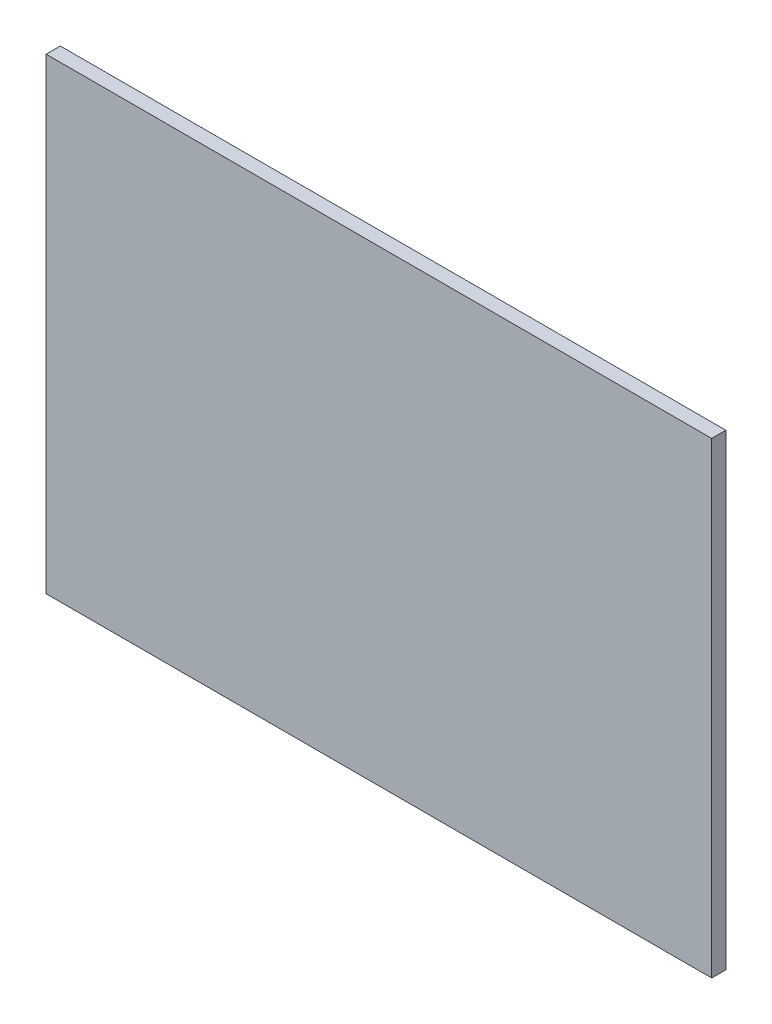
ISO-10303-21;
HEADER;
FILE_DESCRIPTION(('STEP AP214'),'2;1');
FILE_NAME('part.step','',(''),(''),'','','');
FILE_SCHEMA(('AUTOMOTIVE_DESIGN { 1 0 10303 214 1 1 1 1 }'));
ENDSEC;
DATA;
#1=APPLICATION_CONTEXT('core data for automotive mechanical design processes');
#2=APPLICATION_PROTOCOL_DEFINITION('international standard','automotive_design',2000,#1);
#3=PRODUCT_CONTEXT('',#1,'mechanical');
#4=PRODUCT('Part','Part','',(#3));
#5=PRODUCT_RELATED_PRODUCT_CATEGORY('part','',(#4));
#6=PRODUCT_DEFINITION_FORMATION('','',#4);
#7=PRODUCT_DEFINITION_CONTEXT('part definition',#1,'design');
#8=PRODUCT_DEFINITION('design','',#6,#7);
#9=PRODUCT_DEFINITION_SHAPE('','',#8);
#10=(LENGTH_UNIT() NAMED_UNIT(*) SI_UNIT(.MILLI.,.METRE.));
#11=(NAMED_UNIT(*) PLANE_ANGLE_UNIT() SI_UNIT($,.RADIAN.));
#12=(NAMED_UNIT(*) SI_UNIT($,.STERADIAN.) SOLID_ANGLE_UNIT());
#13=UNCERTAINTY_MEASURE_WITH_UNIT(LENGTH_MEASURE(1.E-05),#10,'distance_accuracy_value','');
#14=(GEOMETRIC_REPRESENTATION_CONTEXT(3) GLOBAL_UNCERTAINTY_ASSIGNED_CONTEXT((#13)) GLOBAL_UNIT_ASSIGNED_CONTEXT((#10,
#11,#12)) REPRESENTATION_CONTEXT('',''));
#15=CARTESIAN_POINT('',(0.,0.,0.));
#16=DIRECTION('',(0.,0.,1.));
#17=DIRECTION('',(1.,0.,0.));
#18=AXIS2_PLACEMENT_3D('',#15,#16,#17);
#19=CARTESIAN_POINT('',(0.,0.,10.));
#20=DIRECTION('',(1.,0.,0.));
#21=DIRECTION('',(0.,0.,-1.));
#22=AXIS2_PLACEMENT_3D('',#19,#20,#21);
#23=PLANE('',#22);
#24=DIRECTION('',(0.,-1.,0.));
#25=VECTOR('',#24,1.);
#26=CARTESIAN_POINT('',(0.,0.,0.));
#27=LINE('',#26,#25);
#28=CARTESIAN_POINT('',(0.,330.,0.));
#29=VERTEX_POINT('',#28);
#30=CARTESIAN_POINT('',(0.,0.,0.));
#31=VERTEX_POINT('',#30);
#32=EDGE_CURVE('E98',#29,#31,#27,.T.);
#33=ORIENTED_EDGE('',*,*,#32,.T.);
#34=DIRECTION('',(0.,0.,-1.));
#35=VECTOR('',#34,1.);
#36=CARTESIAN_POINT('',(0.,0.,10.));
#37=LINE('',#36,#35);
#38=CARTESIAN_POINT('',(0.,0.,10.));
#39=VERTEX_POINT('',#38);
#40=EDGE_CURVE('E11',#39,#31,#37,.T.);
#41=ORIENTED_EDGE('',*,*,#40,.F.);
#42=DIRECTION('',(0.,-1.,0.));
#43=VECTOR('',#42,1.);
#44=CARTESIAN_POINT('',(0.,0.,10.));
#45=LINE('',#44,#43);
#46=CARTESIAN_POINT('',(0.,330.,10.));
#47=VERTEX_POINT('',#46);
#48=EDGE_CURVE('E86',#47,#39,#45,.T.);
#49=ORIENTED_EDGE('',*,*,#48,.F.);
#50=DIRECTION('',(0.,0.,-1.));
#51=VECTOR('',#50,1.);
#52=CARTESIAN_POINT('',(0.,330.,10.));
#53=LINE('',#52,#51);
#54=EDGE_CURVE('E94',#47,#29,#53,.T.);
#55=ORIENTED_EDGE('',*,*,#54,.T.);
#56=EDGE_LOOP('',(#33,#41,#49,#55));
#57=FACE_BOUND('',#56,.T.);
#58=ADVANCED_FACE('F35',(#57),#23,.F.);
#59=CARTESIAN_POINT('',(0.,0.,10.));
#60=DIRECTION('',(0.,1.,0.));
#61=DIRECTION('',(0.,0.,1.));
#62=AXIS2_PLACEMENT_3D('',#59,#60,#61);
#63=PLANE('',#62);
#64=DIRECTION('',(1.,0.,0.));
#65=VECTOR('',#64,1.);
#66=CARTESIAN_POINT('',(0.,0.,0.));
#67=LINE('',#66,#65);
#68=CARTESIAN_POINT('',(470.,0.,0.));
#69=VERTEX_POINT('',#68);
#70=EDGE_CURVE('E90',#31,#69,#67,.T.);
#71=ORIENTED_EDGE('',*,*,#70,.T.);
#72=DIRECTION('',(0.,0.,-1.));
#73=VECTOR('',#72,1.);
#74=CARTESIAN_POINT('',(470.,0.,10.));
#75=LINE('',#74,#73);
#76=CARTESIAN_POINT('',(470.,0.,10.));
#77=VERTEX_POINT('',#76);
#78=EDGE_CURVE('E43',#77,#69,#75,.T.);
#79=ORIENTED_EDGE('',*,*,#78,.F.);
#80=DIRECTION('',(1.,0.,0.));
#81=VECTOR('',#80,1.);
#82=CARTESIAN_POINT('',(0.,0.,10.));
#83=LINE('',#82,#81);
#84=EDGE_CURVE('E81',#39,#77,#83,.T.);
#85=ORIENTED_EDGE('',*,*,#84,.F.);
#86=ORIENTED_EDGE('',*,*,#40,.T.);
#87=EDGE_LOOP('',(#71,#79,#85,#86));
#88=FACE_BOUND('',#87,.T.);
#89=ADVANCED_FACE('F89',(#88),#63,.F.);
#90=CARTESIAN_POINT('',(470.,0.,10.));
#91=DIRECTION('',(-1.,0.,0.));
#92=DIRECTION('',(0.,0.,1.));
#93=AXIS2_PLACEMENT_3D('',#90,#91,#92);
#94=PLANE('',#93);
#95=DIRECTION('',(0.,1.,0.));
#96=VECTOR('',#95,1.);
#97=CARTESIAN_POINT('',(470.,0.,0.));
#98=LINE('',#97,#96);
#99=CARTESIAN_POINT('',(470.,330.,0.));
#100=VERTEX_POINT('',#99);
#101=EDGE_CURVE('E68',#69,#100,#98,.T.);
#102=ORIENTED_EDGE('',*,*,#101,.T.);
#103=DIRECTION('',(0.,0.,-1.));
#104=VECTOR('',#103,1.);
#105=CARTESIAN_POINT('',(470.,330.,10.));
#106=LINE('',#105,#104);
#107=CARTESIAN_POINT('',(470.,330.,10.));
#108=VERTEX_POINT('',#107);
#109=EDGE_CURVE('E91',#108,#100,#106,.T.);
#110=ORIENTED_EDGE('',*,*,#109,.F.);
#111=DIRECTION('',(0.,1.,0.));
#112=VECTOR('',#111,1.);
#113=CARTESIAN_POINT('',(470.,0.,10.));
#114=LINE('',#113,#112);
#115=EDGE_CURVE('E84',#77,#108,#114,.T.);
#116=ORIENTED_EDGE('',*,*,#115,.F.);
#117=ORIENTED_EDGE('',*,*,#78,.T.);
#118=EDGE_LOOP('',(#102,#110,#116,#117));
#119=FACE_BOUND('',#118,.T.);
#120=ADVANCED_FACE('F92',(#119),#94,.F.);
#121=CARTESIAN_POINT('',(0.,330.,10.));
#122=DIRECTION('',(0.,-1.,0.));
#123=DIRECTION('',(0.,0.,-1.));
#124=AXIS2_PLACEMENT_3D('',#121,#122,#123);
#125=PLANE('',#124);
#126=DIRECTION('',(-1.,0.,0.));
#127=VECTOR('',#126,1.);
#128=CARTESIAN_POINT('',(0.,330.,0.));
#129=LINE('',#128,#127);
#130=EDGE_CURVE('E74',#100,#29,#129,.T.);
#131=ORIENTED_EDGE('',*,*,#130,.T.);
#132=ORIENTED_EDGE('',*,*,#54,.F.);
#133=DIRECTION('',(-1.,0.,0.));
#134=VECTOR('',#133,1.);
#135=CARTESIAN_POINT('',(0.,330.,10.));
#136=LINE('',#135,#134);
#137=EDGE_CURVE('E51',#108,#47,#136,.T.);
#138=ORIENTED_EDGE('',*,*,#137,.F.);
#139=ORIENTED_EDGE('',*,*,#109,.T.);
#140=EDGE_LOOP('',(#131,#132,#138,#139));
#141=FACE_BOUND('',#140,.T.);
#142=ADVANCED_FACE('F105',(#141),#125,.F.);
#143=CARTESIAN_POINT('',(0.,0.,10.));
#144=DIRECTION('',(0.,0.,-1.));
#145=DIRECTION('',(-1.,0.,0.));
#146=AXIS2_PLACEMENT_3D('',#143,#144,#145);
#147=PLANE('',#146);
#148=ORIENTED_EDGE('',*,*,#48,.T.);
#149=ORIENTED_EDGE('',*,*,#84,.T.);
#150=ORIENTED_EDGE('',*,*,#115,.T.);
#151=ORIENTED_EDGE('',*,*,#137,.T.);
#152=EDGE_LOOP('',(#148,#149,#150,#151));
#153=FACE_BOUND('',#152,.T.);
#154=ADVANCED_FACE('F82',(#153),#147,.F.);
#155=CARTESIAN_POINT('',(0.,0.,0.));
#156=DIRECTION('',(0.,0.,-1.));
#157=DIRECTION('',(-1.,0.,0.));
#158=AXIS2_PLACEMENT_3D('',#155,#156,#157);
#159=PLANE('',#158);
#160=ORIENTED_EDGE('',*,*,#32,.F.);
#161=ORIENTED_EDGE('',*,*,#130,.F.);
#162=ORIENTED_EDGE('',*,*,#101,.F.);
#163=ORIENTED_EDGE('',*,*,#70,.F.);
#164=EDGE_LOOP('',(#160,#161,#162,#163));
#165=FACE_BOUND('',#164,.T.);
#166=ADVANCED_FACE('F108',(#165),#159,.T.);
#167=CLOSED_SHELL('',(#58,#89,#120,#142,#154,#166));
#168=MANIFOLD_SOLID_BREP('B2',#167);
#169=ADVANCED_BREP_SHAPE_REPRESENTATION('',(#18,#168),#14);
#170=SHAPE_DEFINITION_REPRESENTATION(#9,#169);
ENDSEC;
END-ISO-10303-21;
